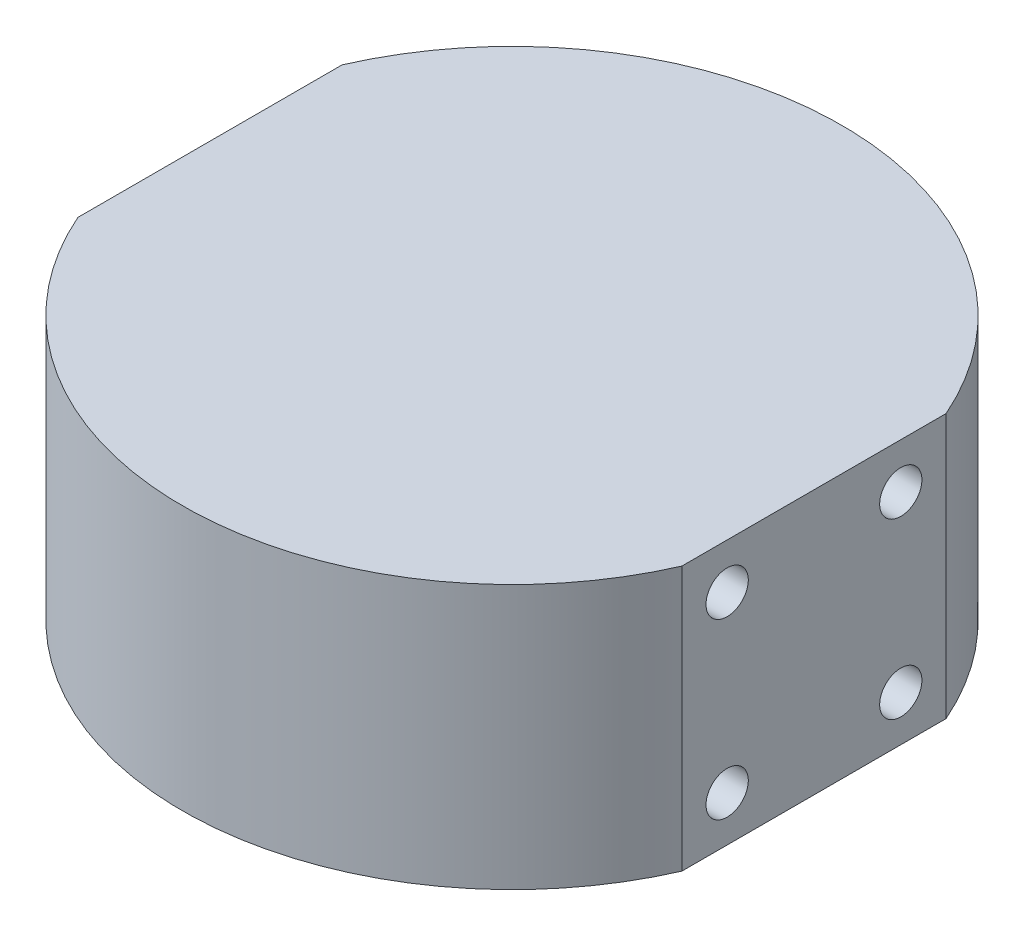
ISO-10303-21;
HEADER;
FILE_DESCRIPTION(('STEP AP214'),'2;1');
FILE_NAME('part.step','',(''),(''),'','','');
FILE_SCHEMA(('AUTOMOTIVE_DESIGN { 1 0 10303 214 1 1 1 1 }'));
ENDSEC;
DATA;
#1=APPLICATION_CONTEXT('core data for automotive mechanical design processes');
#2=APPLICATION_PROTOCOL_DEFINITION('international standard','automotive_design',2000,#1);
#3=PRODUCT_CONTEXT('',#1,'mechanical');
#4=PRODUCT('Part','Part','',(#3));
#5=PRODUCT_RELATED_PRODUCT_CATEGORY('part','',(#4));
#6=PRODUCT_DEFINITION_FORMATION('','',#4);
#7=PRODUCT_DEFINITION_CONTEXT('part definition',#1,'design');
#8=PRODUCT_DEFINITION('design','',#6,#7);
#9=PRODUCT_DEFINITION_SHAPE('','',#8);
#10=(LENGTH_UNIT() NAMED_UNIT(*) SI_UNIT(.MILLI.,.METRE.));
#11=(NAMED_UNIT(*) PLANE_ANGLE_UNIT() SI_UNIT($,.RADIAN.));
#12=(NAMED_UNIT(*) SI_UNIT($,.STERADIAN.) SOLID_ANGLE_UNIT());
#13=UNCERTAINTY_MEASURE_WITH_UNIT(LENGTH_MEASURE(1.E-05),#10,'distance_accuracy_value','');
#14=(GEOMETRIC_REPRESENTATION_CONTEXT(3) GLOBAL_UNCERTAINTY_ASSIGNED_CONTEXT((#13)) GLOBAL_UNIT_ASSIGNED_CONTEXT((#10,
#11,#12)) REPRESENTATION_CONTEXT('',''));
#15=CARTESIAN_POINT('',(0.,0.,0.));
#16=DIRECTION('',(0.,0.,1.));
#17=DIRECTION('',(1.,0.,0.));
#18=AXIS2_PLACEMENT_3D('',#15,#16,#17);
#19=CARTESIAN_POINT('',(0.,35.,0.));
#20=DIRECTION('',(0.,-1.,0.));
#21=DIRECTION('',(0.,0.,-1.));
#22=AXIS2_PLACEMENT_3D('',#19,#20,#21);
#23=CYLINDRICAL_SURFACE('',#22,43.6606229914324);
#24=CARTESIAN_POINT('',(0.,0.,0.));
#25=DIRECTION('',(0.,1.,0.));
#26=DIRECTION('',(0.,0.,1.));
#27=AXIS2_PLACEMENT_3D('',#24,#25,#26);
#28=CIRCLE('',#27,43.6606229914324);
#29=CARTESIAN_POINT('',(40.,0.,-17.5));
#30=VERTEX_POINT('',#29);
#31=CARTESIAN_POINT('',(-40.,0.,-17.5));
#32=VERTEX_POINT('',#31);
#33=EDGE_CURVE('E102',#30,#32,#28,.T.);
#34=ORIENTED_EDGE('',*,*,#33,.T.);
#35=DIRECTION('',(0.,-1.,0.));
#36=VECTOR('',#35,1.);
#37=CARTESIAN_POINT('',(-40.,35.,-17.5));
#38=LINE('',#37,#36);
#39=CARTESIAN_POINT('',(-40.,35.,-17.5));
#40=VERTEX_POINT('',#39);
#41=EDGE_CURVE('E11',#40,#32,#38,.T.);
#42=ORIENTED_EDGE('',*,*,#41,.F.);
#43=CARTESIAN_POINT('',(0.,35.,0.));
#44=DIRECTION('',(0.,1.,0.));
#45=DIRECTION('',(0.,0.,1.));
#46=AXIS2_PLACEMENT_3D('',#43,#44,#45);
#47=CIRCLE('',#46,43.6606229914324);
#48=CARTESIAN_POINT('',(40.,35.,-17.5));
#49=VERTEX_POINT('',#48);
#50=EDGE_CURVE('E90',#49,#40,#47,.T.);
#51=ORIENTED_EDGE('',*,*,#50,.F.);
#52=DIRECTION('',(0.,-1.,0.));
#53=VECTOR('',#52,1.);
#54=CARTESIAN_POINT('',(40.,35.,-17.5));
#55=LINE('',#54,#53);
#56=EDGE_CURVE('E98',#49,#30,#55,.T.);
#57=ORIENTED_EDGE('',*,*,#56,.T.);
#58=EDGE_LOOP('',(#34,#42,#51,#57));
#59=FACE_BOUND('',#58,.T.);
#60=ADVANCED_FACE('F39',(#59),#23,.T.);
#61=CARTESIAN_POINT('',(-40.,35.,-17.5));
#62=DIRECTION('',(1.,0.,0.));
#63=DIRECTION('',(0.,0.,-1.));
#64=AXIS2_PLACEMENT_3D('',#61,#62,#63);
#65=PLANE('',#64);
#66=CARTESIAN_POINT('',(-40.,29.,11.5));
#67=DIRECTION('',(-1.,0.,0.));
#68=DIRECTION('',(0.,0.,1.));
#69=AXIS2_PLACEMENT_3D('',#66,#67,#68);
#70=CIRCLE('',#69,2.8);
#71=CARTESIAN_POINT('',(-40.,29.,14.3));
#72=VERTEX_POINT('',#71);
#73=EDGE_CURVE('E119',#72,#72,#70,.T.);
#74=ORIENTED_EDGE('',*,*,#73,.F.);
#75=EDGE_LOOP('',(#74));
#76=FACE_BOUND('',#75,.T.);
#77=CARTESIAN_POINT('',(-40.,6.,-11.5));
#78=DIRECTION('',(-1.,0.,0.));
#79=DIRECTION('',(0.,0.,1.));
#80=AXIS2_PLACEMENT_3D('',#77,#78,#79);
#81=CIRCLE('',#80,2.8);
#82=CARTESIAN_POINT('',(-40.,6.,-8.7));
#83=VERTEX_POINT('',#82);
#84=EDGE_CURVE('E125',#83,#83,#81,.T.);
#85=ORIENTED_EDGE('',*,*,#84,.F.);
#86=EDGE_LOOP('',(#85));
#87=FACE_BOUND('',#86,.T.);
#88=CARTESIAN_POINT('',(-40.,6.,11.5));
#89=DIRECTION('',(-1.,0.,0.));
#90=DIRECTION('',(0.,0.,1.));
#91=AXIS2_PLACEMENT_3D('',#88,#89,#90);
#92=CIRCLE('',#91,2.8);
#93=CARTESIAN_POINT('',(-40.,6.,14.3));
#94=VERTEX_POINT('',#93);
#95=EDGE_CURVE('E126',#94,#94,#92,.T.);
#96=ORIENTED_EDGE('',*,*,#95,.F.);
#97=EDGE_LOOP('',(#96));
#98=FACE_BOUND('',#97,.T.);
#99=CARTESIAN_POINT('',(-40.,29.,-11.5));
#100=DIRECTION('',(-1.,0.,0.));
#101=DIRECTION('',(0.,0.,1.));
#102=AXIS2_PLACEMENT_3D('',#99,#100,#101);
#103=CIRCLE('',#102,2.8);
#104=CARTESIAN_POINT('',(-40.,29.,-8.7));
#105=VERTEX_POINT('',#104);
#106=EDGE_CURVE('E116',#105,#105,#103,.T.);
#107=ORIENTED_EDGE('',*,*,#106,.F.);
#108=EDGE_LOOP('',(#107));
#109=FACE_BOUND('',#108,.T.);
#110=DIRECTION('',(0.,0.,1.));
#111=VECTOR('',#110,1.);
#112=CARTESIAN_POINT('',(-40.,0.,-17.5));
#113=LINE('',#112,#111);
#114=CARTESIAN_POINT('',(-40.,0.,17.5));
#115=VERTEX_POINT('',#114);
#116=EDGE_CURVE('E94',#32,#115,#113,.T.);
#117=ORIENTED_EDGE('',*,*,#116,.T.);
#118=DIRECTION('',(0.,-1.,0.));
#119=VECTOR('',#118,1.);
#120=CARTESIAN_POINT('',(-40.,35.,17.5));
#121=LINE('',#120,#119);
#122=CARTESIAN_POINT('',(-40.,35.,17.5));
#123=VERTEX_POINT('',#122);
#124=EDGE_CURVE('E47',#123,#115,#121,.T.);
#125=ORIENTED_EDGE('',*,*,#124,.F.);
#126=DIRECTION('',(0.,0.,1.));
#127=VECTOR('',#126,1.);
#128=CARTESIAN_POINT('',(-40.,35.,-17.5));
#129=LINE('',#128,#127);
#130=EDGE_CURVE('E85',#40,#123,#129,.T.);
#131=ORIENTED_EDGE('',*,*,#130,.F.);
#132=ORIENTED_EDGE('',*,*,#41,.T.);
#133=EDGE_LOOP('',(#117,#125,#131,#132));
#134=FACE_BOUND('',#133,.T.);
#135=ADVANCED_FACE('F93',(#76,#87,#98,#109,#134),#65,.F.);
#136=CARTESIAN_POINT('',(0.,35.,0.));
#137=DIRECTION('',(0.,-1.,0.));
#138=DIRECTION('',(0.,0.,-1.));
#139=AXIS2_PLACEMENT_3D('',#136,#137,#138);
#140=CYLINDRICAL_SURFACE('',#139,43.6606229914324);
#141=CARTESIAN_POINT('',(0.,0.,0.));
#142=DIRECTION('',(0.,1.,0.));
#143=DIRECTION('',(0.,0.,1.));
#144=AXIS2_PLACEMENT_3D('',#141,#142,#143);
#145=CIRCLE('',#144,43.6606229914324);
#146=CARTESIAN_POINT('',(40.,0.,17.5));
#147=VERTEX_POINT('',#146);
#148=EDGE_CURVE('E72',#115,#147,#145,.T.);
#149=ORIENTED_EDGE('',*,*,#148,.T.);
#150=DIRECTION('',(0.,-1.,0.));
#151=VECTOR('',#150,1.);
#152=CARTESIAN_POINT('',(40.,35.,17.5));
#153=LINE('',#152,#151);
#154=CARTESIAN_POINT('',(40.,35.,17.5));
#155=VERTEX_POINT('',#154);
#156=EDGE_CURVE('E95',#155,#147,#153,.T.);
#157=ORIENTED_EDGE('',*,*,#156,.F.);
#158=CARTESIAN_POINT('',(0.,35.,0.));
#159=DIRECTION('',(0.,1.,0.));
#160=DIRECTION('',(0.,0.,1.));
#161=AXIS2_PLACEMENT_3D('',#158,#159,#160);
#162=CIRCLE('',#161,43.6606229914324);
#163=EDGE_CURVE('E88',#123,#155,#162,.T.);
#164=ORIENTED_EDGE('',*,*,#163,.F.);
#165=ORIENTED_EDGE('',*,*,#124,.T.);
#166=EDGE_LOOP('',(#149,#157,#164,#165));
#167=FACE_BOUND('',#166,.T.);
#168=ADVANCED_FACE('F96',(#167),#140,.T.);
#169=CARTESIAN_POINT('',(40.,35.,-17.5));
#170=DIRECTION('',(-1.,0.,0.));
#171=DIRECTION('',(0.,0.,1.));
#172=AXIS2_PLACEMENT_3D('',#169,#170,#171);
#173=PLANE('',#172);
#174=CARTESIAN_POINT('',(40.,29.,11.5));
#175=DIRECTION('',(-1.,0.,0.));
#176=DIRECTION('',(0.,0.,1.));
#177=AXIS2_PLACEMENT_3D('',#174,#175,#176);
#178=CIRCLE('',#177,2.8);
#179=CARTESIAN_POINT('',(40.,29.,14.3));
#180=VERTEX_POINT('',#179);
#181=EDGE_CURVE('E153',#180,#180,#178,.T.);
#182=ORIENTED_EDGE('',*,*,#181,.T.);
#183=EDGE_LOOP('',(#182));
#184=FACE_BOUND('',#183,.T.);
#185=CARTESIAN_POINT('',(40.,6.,-11.5));
#186=DIRECTION('',(-1.,0.,0.));
#187=DIRECTION('',(0.,0.,1.));
#188=AXIS2_PLACEMENT_3D('',#185,#186,#187);
#189=CIRCLE('',#188,2.8);
#190=CARTESIAN_POINT('',(40.,6.,-8.7));
#191=VERTEX_POINT('',#190);
#192=EDGE_CURVE('E146',#191,#191,#189,.T.);
#193=ORIENTED_EDGE('',*,*,#192,.T.);
#194=EDGE_LOOP('',(#193));
#195=FACE_BOUND('',#194,.T.);
#196=CARTESIAN_POINT('',(40.,6.,11.5));
#197=DIRECTION('',(-1.,0.,0.));
#198=DIRECTION('',(0.,0.,1.));
#199=AXIS2_PLACEMENT_3D('',#196,#197,#198);
#200=CIRCLE('',#199,2.8);
#201=CARTESIAN_POINT('',(40.,6.,14.3));
#202=VERTEX_POINT('',#201);
#203=EDGE_CURVE('E158',#202,#202,#200,.T.);
#204=ORIENTED_EDGE('',*,*,#203,.T.);
#205=EDGE_LOOP('',(#204));
#206=FACE_BOUND('',#205,.T.);
#207=CARTESIAN_POINT('',(40.,29.,-11.5));
#208=DIRECTION('',(-1.,0.,0.));
#209=DIRECTION('',(0.,0.,1.));
#210=AXIS2_PLACEMENT_3D('',#207,#208,#209);
#211=CIRCLE('',#210,2.8);
#212=CARTESIAN_POINT('',(40.,29.,-8.7));
#213=VERTEX_POINT('',#212);
#214=EDGE_CURVE('E140',#213,#213,#211,.T.);
#215=ORIENTED_EDGE('',*,*,#214,.T.);
#216=EDGE_LOOP('',(#215));
#217=FACE_BOUND('',#216,.T.);
#218=DIRECTION('',(0.,0.,-1.));
#219=VECTOR('',#218,1.);
#220=CARTESIAN_POINT('',(40.,0.,-17.5));
#221=LINE('',#220,#219);
#222=EDGE_CURVE('E78',#147,#30,#221,.T.);
#223=ORIENTED_EDGE('',*,*,#222,.T.);
#224=ORIENTED_EDGE('',*,*,#56,.F.);
#225=DIRECTION('',(0.,0.,-1.));
#226=VECTOR('',#225,1.);
#227=CARTESIAN_POINT('',(40.,35.,-17.5));
#228=LINE('',#227,#226);
#229=EDGE_CURVE('E55',#155,#49,#228,.T.);
#230=ORIENTED_EDGE('',*,*,#229,.F.);
#231=ORIENTED_EDGE('',*,*,#156,.T.);
#232=EDGE_LOOP('',(#223,#224,#230,#231));
#233=FACE_BOUND('',#232,.T.);
#234=ADVANCED_FACE('F110',(#184,#195,#206,#217,#233),#173,.F.);
#235=CARTESIAN_POINT('',(0.,35.,0.));
#236=DIRECTION('',(0.,1.,0.));
#237=DIRECTION('',(0.,0.,1.));
#238=AXIS2_PLACEMENT_3D('',#235,#236,#237);
#239=PLANE('',#238);
#240=ORIENTED_EDGE('',*,*,#50,.T.);
#241=ORIENTED_EDGE('',*,*,#130,.T.);
#242=ORIENTED_EDGE('',*,*,#163,.T.);
#243=ORIENTED_EDGE('',*,*,#229,.T.);
#244=EDGE_LOOP('',(#240,#241,#242,#243));
#245=FACE_BOUND('',#244,.T.);
#246=ADVANCED_FACE('F86',(#245),#239,.T.);
#247=CARTESIAN_POINT('',(0.,0.,0.));
#248=DIRECTION('',(0.,1.,0.));
#249=DIRECTION('',(0.,0.,1.));
#250=AXIS2_PLACEMENT_3D('',#247,#248,#249);
#251=PLANE('',#250);
#252=ORIENTED_EDGE('',*,*,#33,.F.);
#253=ORIENTED_EDGE('',*,*,#222,.F.);
#254=ORIENTED_EDGE('',*,*,#148,.F.);
#255=ORIENTED_EDGE('',*,*,#116,.F.);
#256=EDGE_LOOP('',(#252,#253,#254,#255));
#257=FACE_BOUND('',#256,.T.);
#258=ADVANCED_FACE('F113',(#257),#251,.F.);
#259=CARTESIAN_POINT('',(-30.,29.,-11.5));
#260=DIRECTION('',(-1.,0.,0.));
#261=DIRECTION('',(0.,0.,1.));
#262=AXIS2_PLACEMENT_3D('',#259,#260,#261);
#263=CYLINDRICAL_SURFACE('',#262,2.8);
#264=CARTESIAN_POINT('',(-30.,29.,-11.5));
#265=DIRECTION('',(-1.,0.,0.));
#266=DIRECTION('',(0.,0.,1.));
#267=AXIS2_PLACEMENT_3D('',#264,#265,#266);
#268=CIRCLE('',#267,2.8);
#269=CARTESIAN_POINT('',(-30.,29.,-8.7));
#270=VERTEX_POINT('',#269);
#271=EDGE_CURVE('E105',#270,#270,#268,.T.);
#272=ORIENTED_EDGE('',*,*,#271,.F.);
#273=EDGE_LOOP('',(#272));
#274=FACE_BOUND('',#273,.T.);
#275=ORIENTED_EDGE('',*,*,#106,.T.);
#276=EDGE_LOOP('',(#275));
#277=FACE_BOUND('',#276,.T.);
#278=ADVANCED_FACE('F198',(#274,#277),#263,.F.);
#279=CARTESIAN_POINT('',(-30.,29.,-11.5));
#280=DIRECTION('',(-1.,0.,0.));
#281=DIRECTION('',(0.,0.,1.));
#282=AXIS2_PLACEMENT_3D('',#279,#280,#281);
#283=PLANE('',#282);
#284=ORIENTED_EDGE('',*,*,#271,.T.);
#285=EDGE_LOOP('',(#284));
#286=FACE_BOUND('',#285,.T.);
#287=ADVANCED_FACE('F202',(#286),#283,.T.);
#288=CARTESIAN_POINT('',(-30.,6.,11.5));
#289=DIRECTION('',(-1.,0.,0.));
#290=DIRECTION('',(0.,0.,1.));
#291=AXIS2_PLACEMENT_3D('',#288,#289,#290);
#292=CYLINDRICAL_SURFACE('',#291,2.8);
#293=CARTESIAN_POINT('',(-30.,6.,11.5));
#294=DIRECTION('',(-1.,0.,0.));
#295=DIRECTION('',(0.,0.,1.));
#296=AXIS2_PLACEMENT_3D('',#293,#294,#295);
#297=CIRCLE('',#296,2.8);
#298=CARTESIAN_POINT('',(-30.,6.,14.3));
#299=VERTEX_POINT('',#298);
#300=EDGE_CURVE('E134',#299,#299,#297,.T.);
#301=ORIENTED_EDGE('',*,*,#300,.F.);
#302=EDGE_LOOP('',(#301));
#303=FACE_BOUND('',#302,.T.);
#304=ORIENTED_EDGE('',*,*,#95,.T.);
#305=EDGE_LOOP('',(#304));
#306=FACE_BOUND('',#305,.T.);
#307=ADVANCED_FACE('F206',(#303,#306),#292,.F.);
#308=CARTESIAN_POINT('',(-30.,6.,11.5));
#309=DIRECTION('',(-1.,0.,0.));
#310=DIRECTION('',(0.,0.,1.));
#311=AXIS2_PLACEMENT_3D('',#308,#309,#310);
#312=PLANE('',#311);
#313=ORIENTED_EDGE('',*,*,#300,.T.);
#314=EDGE_LOOP('',(#313));
#315=FACE_BOUND('',#314,.T.);
#316=ADVANCED_FACE('F216',(#315),#312,.T.);
#317=CARTESIAN_POINT('',(-30.,6.,-11.5));
#318=DIRECTION('',(-1.,0.,0.));
#319=DIRECTION('',(0.,0.,1.));
#320=AXIS2_PLACEMENT_3D('',#317,#318,#319);
#321=CYLINDRICAL_SURFACE('',#320,2.8);
#322=CARTESIAN_POINT('',(-30.,6.,-11.5));
#323=DIRECTION('',(-1.,0.,0.));
#324=DIRECTION('',(0.,0.,1.));
#325=AXIS2_PLACEMENT_3D('',#322,#323,#324);
#326=CIRCLE('',#325,2.8);
#327=CARTESIAN_POINT('',(-30.,6.,-8.7));
#328=VERTEX_POINT('',#327);
#329=EDGE_CURVE('E122',#328,#328,#326,.T.);
#330=ORIENTED_EDGE('',*,*,#329,.F.);
#331=EDGE_LOOP('',(#330));
#332=FACE_BOUND('',#331,.T.);
#333=ORIENTED_EDGE('',*,*,#84,.T.);
#334=EDGE_LOOP('',(#333));
#335=FACE_BOUND('',#334,.T.);
#336=ADVANCED_FACE('F212',(#332,#335),#321,.F.);
#337=CARTESIAN_POINT('',(-30.,6.,-11.5));
#338=DIRECTION('',(-1.,0.,0.));
#339=DIRECTION('',(0.,0.,1.));
#340=AXIS2_PLACEMENT_3D('',#337,#338,#339);
#341=PLANE('',#340);
#342=ORIENTED_EDGE('',*,*,#329,.T.);
#343=EDGE_LOOP('',(#342));
#344=FACE_BOUND('',#343,.T.);
#345=ADVANCED_FACE('F208',(#344),#341,.T.);
#346=CARTESIAN_POINT('',(-30.,29.,11.5));
#347=DIRECTION('',(-1.,0.,0.));
#348=DIRECTION('',(0.,0.,1.));
#349=AXIS2_PLACEMENT_3D('',#346,#347,#348);
#350=CYLINDRICAL_SURFACE('',#349,2.8);
#351=CARTESIAN_POINT('',(-30.,29.,11.5));
#352=DIRECTION('',(-1.,0.,0.));
#353=DIRECTION('',(0.,0.,1.));
#354=AXIS2_PLACEMENT_3D('',#351,#352,#353);
#355=CIRCLE('',#354,2.8);
#356=CARTESIAN_POINT('',(-30.,29.,14.3));
#357=VERTEX_POINT('',#356);
#358=EDGE_CURVE('E129',#357,#357,#355,.T.);
#359=ORIENTED_EDGE('',*,*,#358,.F.);
#360=EDGE_LOOP('',(#359));
#361=FACE_BOUND('',#360,.T.);
#362=ORIENTED_EDGE('',*,*,#73,.T.);
#363=EDGE_LOOP('',(#362));
#364=FACE_BOUND('',#363,.T.);
#365=ADVANCED_FACE('F211',(#361,#364),#350,.F.);
#366=CARTESIAN_POINT('',(-30.,29.,11.5));
#367=DIRECTION('',(-1.,0.,0.));
#368=DIRECTION('',(0.,0.,1.));
#369=AXIS2_PLACEMENT_3D('',#366,#367,#368);
#370=PLANE('',#369);
#371=ORIENTED_EDGE('',*,*,#358,.T.);
#372=EDGE_LOOP('',(#371));
#373=FACE_BOUND('',#372,.T.);
#374=ADVANCED_FACE('F218',(#373),#370,.T.);
#375=CARTESIAN_POINT('',(30.,29.,-11.5));
#376=DIRECTION('',(1.,0.,0.));
#377=DIRECTION('',(0.,0.,-1.));
#378=AXIS2_PLACEMENT_3D('',#375,#376,#377);
#379=CYLINDRICAL_SURFACE('',#378,2.8);
#380=CARTESIAN_POINT('',(30.,29.,-11.5));
#381=DIRECTION('',(-1.,0.,0.));
#382=DIRECTION('',(0.,0.,1.));
#383=AXIS2_PLACEMENT_3D('',#380,#381,#382);
#384=CIRCLE('',#383,2.8);
#385=CARTESIAN_POINT('',(30.,29.,-8.7));
#386=VERTEX_POINT('',#385);
#387=EDGE_CURVE('E137',#386,#386,#384,.T.);
#388=ORIENTED_EDGE('',*,*,#387,.T.);
#389=EDGE_LOOP('',(#388));
#390=FACE_BOUND('',#389,.T.);
#391=ORIENTED_EDGE('',*,*,#214,.F.);
#392=EDGE_LOOP('',(#391));
#393=FACE_BOUND('',#392,.T.);
#394=ADVANCED_FACE('F221',(#390,#393),#379,.F.);
#395=CARTESIAN_POINT('',(30.,29.,-11.5));
#396=DIRECTION('',(-1.,0.,0.));
#397=DIRECTION('',(0.,0.,1.));
#398=AXIS2_PLACEMENT_3D('',#395,#396,#397);
#399=PLANE('',#398);
#400=ORIENTED_EDGE('',*,*,#387,.F.);
#401=EDGE_LOOP('',(#400));
#402=FACE_BOUND('',#401,.T.);
#403=ADVANCED_FACE('F178',(#402),#399,.F.);
#404=CARTESIAN_POINT('',(30.,6.,11.5));
#405=DIRECTION('',(1.,0.,0.));
#406=DIRECTION('',(0.,0.,-1.));
#407=AXIS2_PLACEMENT_3D('',#404,#405,#406);
#408=CYLINDRICAL_SURFACE('',#407,2.8);
#409=CARTESIAN_POINT('',(30.,6.,11.5));
#410=DIRECTION('',(-1.,0.,0.));
#411=DIRECTION('',(0.,0.,1.));
#412=AXIS2_PLACEMENT_3D('',#409,#410,#411);
#413=CIRCLE('',#412,2.8);
#414=CARTESIAN_POINT('',(30.,6.,14.3));
#415=VERTEX_POINT('',#414);
#416=EDGE_CURVE('E150',#415,#415,#413,.T.);
#417=ORIENTED_EDGE('',*,*,#416,.T.);
#418=EDGE_LOOP('',(#417));
#419=FACE_BOUND('',#418,.T.);
#420=ORIENTED_EDGE('',*,*,#203,.F.);
#421=EDGE_LOOP('',(#420));
#422=FACE_BOUND('',#421,.T.);
#423=ADVANCED_FACE('F164',(#419,#422),#408,.F.);
#424=CARTESIAN_POINT('',(30.,6.,11.5));
#425=DIRECTION('',(-1.,0.,0.));
#426=DIRECTION('',(0.,0.,1.));
#427=AXIS2_PLACEMENT_3D('',#424,#425,#426);
#428=PLANE('',#427);
#429=ORIENTED_EDGE('',*,*,#416,.F.);
#430=EDGE_LOOP('',(#429));
#431=FACE_BOUND('',#430,.T.);
#432=ADVANCED_FACE('F167',(#431),#428,.F.);
#433=CARTESIAN_POINT('',(30.,6.,-11.5));
#434=DIRECTION('',(1.,0.,0.));
#435=DIRECTION('',(0.,0.,-1.));
#436=AXIS2_PLACEMENT_3D('',#433,#434,#435);
#437=CYLINDRICAL_SURFACE('',#436,2.8);
#438=CARTESIAN_POINT('',(30.,6.,-11.5));
#439=DIRECTION('',(-1.,0.,0.));
#440=DIRECTION('',(0.,0.,1.));
#441=AXIS2_PLACEMENT_3D('',#438,#439,#440);
#442=CIRCLE('',#441,2.8);
#443=CARTESIAN_POINT('',(30.,6.,-8.7));
#444=VERTEX_POINT('',#443);
#445=EDGE_CURVE('E149',#444,#444,#442,.T.);
#446=ORIENTED_EDGE('',*,*,#445,.T.);
#447=EDGE_LOOP('',(#446));
#448=FACE_BOUND('',#447,.T.);
#449=ORIENTED_EDGE('',*,*,#192,.F.);
#450=EDGE_LOOP('',(#449));
#451=FACE_BOUND('',#450,.T.);
#452=ADVANCED_FACE('F169',(#448,#451),#437,.F.);
#453=CARTESIAN_POINT('',(30.,6.,-11.5));
#454=DIRECTION('',(-1.,0.,0.));
#455=DIRECTION('',(0.,0.,1.));
#456=AXIS2_PLACEMENT_3D('',#453,#454,#455);
#457=PLANE('',#456);
#458=ORIENTED_EDGE('',*,*,#445,.F.);
#459=EDGE_LOOP('',(#458));
#460=FACE_BOUND('',#459,.T.);
#461=ADVANCED_FACE('F175',(#460),#457,.F.);
#462=CARTESIAN_POINT('',(30.,29.,11.5));
#463=DIRECTION('',(1.,0.,0.));
#464=DIRECTION('',(0.,0.,-1.));
#465=AXIS2_PLACEMENT_3D('',#462,#463,#464);
#466=CYLINDRICAL_SURFACE('',#465,2.8);
#467=CARTESIAN_POINT('',(30.,29.,11.5));
#468=DIRECTION('',(-1.,0.,0.));
#469=DIRECTION('',(0.,0.,1.));
#470=AXIS2_PLACEMENT_3D('',#467,#468,#469);
#471=CIRCLE('',#470,2.8);
#472=CARTESIAN_POINT('',(30.,29.,14.3));
#473=VERTEX_POINT('',#472);
#474=EDGE_CURVE('E143',#473,#473,#471,.T.);
#475=ORIENTED_EDGE('',*,*,#474,.T.);
#476=EDGE_LOOP('',(#475));
#477=FACE_BOUND('',#476,.T.);
#478=ORIENTED_EDGE('',*,*,#181,.F.);
#479=EDGE_LOOP('',(#478));
#480=FACE_BOUND('',#479,.T.);
#481=ADVANCED_FACE('F240',(#477,#480),#466,.F.);
#482=CARTESIAN_POINT('',(30.,29.,11.5));
#483=DIRECTION('',(-1.,0.,0.));
#484=DIRECTION('',(0.,0.,1.));
#485=AXIS2_PLACEMENT_3D('',#482,#483,#484);
#486=PLANE('',#485);
#487=ORIENTED_EDGE('',*,*,#474,.F.);
#488=EDGE_LOOP('',(#487));
#489=FACE_BOUND('',#488,.T.);
#490=ADVANCED_FACE('F244',(#489),#486,.F.);
#491=CLOSED_SHELL('',(#60,#135,#168,#234,#246,#258,#278,#287,#307,#316,#336,#345,#365,#374,#394,
#403,#423,#432,#452,#461,#481,#490));
#492=MANIFOLD_SOLID_BREP('B2',#491);
#493=ADVANCED_BREP_SHAPE_REPRESENTATION('',(#18,#492),#14);
#494=SHAPE_DEFINITION_REPRESENTATION(#9,#493);
ENDSEC;
END-ISO-10303-21;
